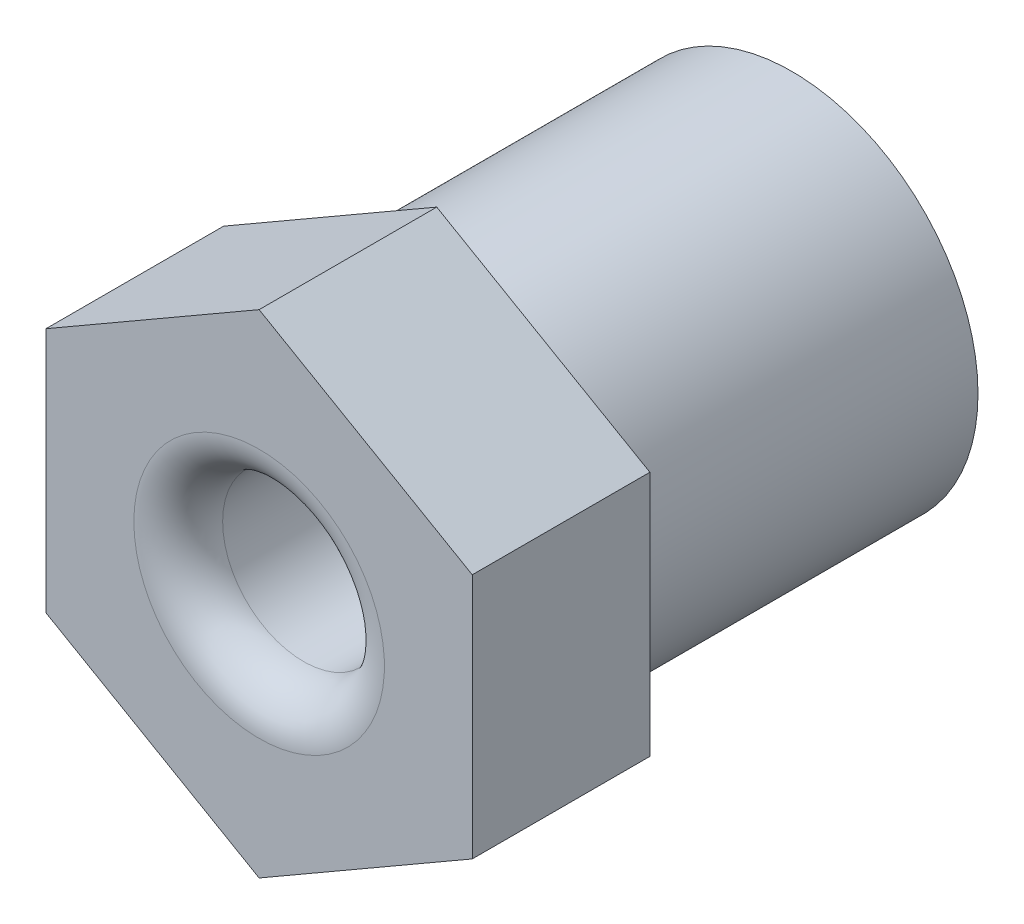
ISO-10303-21;
HEADER;
FILE_DESCRIPTION(('STEP AP214'),'2;1');
FILE_NAME('part.step','',(''),(''),'','','');
FILE_SCHEMA(('AUTOMOTIVE_DESIGN { 1 0 10303 214 1 1 1 1 }'));
ENDSEC;
DATA;
#1=APPLICATION_CONTEXT('core data for automotive mechanical design processes');
#2=APPLICATION_PROTOCOL_DEFINITION('international standard','automotive_design',2000,#1);
#3=PRODUCT_CONTEXT('',#1,'mechanical');
#4=PRODUCT('Part','Part','',(#3));
#5=PRODUCT_RELATED_PRODUCT_CATEGORY('part','',(#4));
#6=PRODUCT_DEFINITION_FORMATION('','',#4);
#7=PRODUCT_DEFINITION_CONTEXT('part definition',#1,'design');
#8=PRODUCT_DEFINITION('design','',#6,#7);
#9=PRODUCT_DEFINITION_SHAPE('','',#8);
#10=(LENGTH_UNIT() NAMED_UNIT(*) SI_UNIT(.MILLI.,.METRE.));
#11=(NAMED_UNIT(*) PLANE_ANGLE_UNIT() SI_UNIT($,.RADIAN.));
#12=(NAMED_UNIT(*) SI_UNIT($,.STERADIAN.) SOLID_ANGLE_UNIT());
#13=UNCERTAINTY_MEASURE_WITH_UNIT(LENGTH_MEASURE(1.E-05),#10,'distance_accuracy_value','');
#14=(GEOMETRIC_REPRESENTATION_CONTEXT(3) GLOBAL_UNCERTAINTY_ASSIGNED_CONTEXT((#13)) GLOBAL_UNIT_ASSIGNED_CONTEXT((#10,
#11,#12)) REPRESENTATION_CONTEXT('',''));
#15=CARTESIAN_POINT('',(0.,0.,0.));
#16=DIRECTION('',(0.,0.,1.));
#17=DIRECTION('',(1.,0.,0.));
#18=AXIS2_PLACEMENT_3D('',#15,#16,#17);
#19=CARTESIAN_POINT('',(-3.65791116486798,3.45094953686021,0.));
#20=DIRECTION('',(0.,0.,1.));
#21=DIRECTION('',(1.,0.,0.));
#22=AXIS2_PLACEMENT_3D('',#19,#20,#21);
#23=PLANE('',#22);
#24=CARTESIAN_POINT('',(-3.65791116486798,3.45094953686021,0.));
#25=DIRECTION('',(0.,0.,1.));
#26=DIRECTION('',(-1.,0.,0.));
#27=AXIS2_PLACEMENT_3D('',#24,#25,#26);
#28=CIRCLE('',#27,0.91087);
#29=CARTESIAN_POINT('',(-4.56878116486798,3.45094953686021,0.));
#30=VERTEX_POINT('',#29);
#31=EDGE_CURVE('E118',#30,#30,#28,.T.);
#32=ORIENTED_EDGE('',*,*,#31,.T.);
#33=EDGE_LOOP('',(#32));
#34=FACE_BOUND('',#33,.T.);
#35=CARTESIAN_POINT('',(-3.65791116486798,3.45094953686021,0.));
#36=DIRECTION('',(0.,0.,-1.));
#37=DIRECTION('',(1.,0.,0.));
#38=AXIS2_PLACEMENT_3D('',#35,#36,#37);
#39=CIRCLE('',#38,1.6);
#40=CARTESIAN_POINT('',(-2.05791116486798,3.45094953686021,0.));
#41=VERTEX_POINT('',#40);
#42=EDGE_CURVE('E127',#41,#41,#39,.T.);
#43=ORIENTED_EDGE('',*,*,#42,.T.);
#44=EDGE_LOOP('',(#43));
#45=FACE_BOUND('',#44,.T.);
#46=ADVANCED_FACE('F17',(#34,#45),#23,.F.);
#47=CARTESIAN_POINT('',(-1.25791116486653,4.83659053686006,0.));
#48=DIRECTION('',(1.,0.,0.));
#49=DIRECTION('',(0.,1.,0.));
#50=AXIS2_PLACEMENT_3D('',#47,#48,#49);
#51=PLANE('',#50);
#52=DIRECTION('',(0.,-1.,0.));
#53=VECTOR('',#52,1.);
#54=CARTESIAN_POINT('',(-1.25791116486653,4.83659053686006,2.));
#55=LINE('',#54,#53);
#56=CARTESIAN_POINT('',(-1.25791116486653,4.83659053686006,2.));
#57=VERTEX_POINT('',#56);
#58=CARTESIAN_POINT('',(-1.25791116486653,2.06530853686036,2.));
#59=VERTEX_POINT('',#58);
#60=EDGE_CURVE('E161',#57,#59,#55,.T.);
#61=ORIENTED_EDGE('',*,*,#60,.T.);
#62=DIRECTION('',(0.,0.,1.));
#63=VECTOR('',#62,1.);
#64=CARTESIAN_POINT('',(-1.25791116486653,2.06530853686036,0.));
#65=LINE('',#64,#63);
#66=CARTESIAN_POINT('',(-1.25791116486653,2.06530853686036,0.));
#67=VERTEX_POINT('',#66);
#68=EDGE_CURVE('E154',#67,#59,#65,.T.);
#69=ORIENTED_EDGE('',*,*,#68,.F.);
#70=DIRECTION('',(0.,-1.,0.));
#71=VECTOR('',#70,1.);
#72=CARTESIAN_POINT('',(-1.25791116486653,4.83659053686006,0.));
#73=LINE('',#72,#71);
#74=CARTESIAN_POINT('',(-1.25791116486653,4.83659053686006,0.));
#75=VERTEX_POINT('',#74);
#76=EDGE_CURVE('E146',#75,#67,#73,.T.);
#77=ORIENTED_EDGE('',*,*,#76,.F.);
#78=DIRECTION('',(0.,0.,1.));
#79=VECTOR('',#78,1.);
#80=CARTESIAN_POINT('',(-1.25791116486653,4.83659053686006,0.));
#81=LINE('',#80,#79);
#82=EDGE_CURVE('E11',#75,#57,#81,.T.);
#83=ORIENTED_EDGE('',*,*,#82,.T.);
#84=EDGE_LOOP('',(#61,#69,#77,#83));
#85=FACE_BOUND('',#84,.T.);
#86=ADVANCED_FACE('F189',(#85),#51,.T.);
#87=CARTESIAN_POINT('',(-3.65791116486798,6.22223053686048,0.));
#88=DIRECTION('',(0.499999825156066,0.866025504730608,0.));
#89=DIRECTION('',(0.,0.,-1.));
#90=AXIS2_PLACEMENT_3D('',#87,#88,#89);
#91=PLANE('',#90);
#92=DIRECTION('',(0.866025504730608,-0.499999825156065,0.));
#93=VECTOR('',#92,1.);
#94=CARTESIAN_POINT('',(-3.65791116486798,6.22223053686048,2.));
#95=LINE('',#94,#93);
#96=CARTESIAN_POINT('',(-3.65791116486798,6.22223053686048,2.));
#97=VERTEX_POINT('',#96);
#98=EDGE_CURVE('E162',#97,#57,#95,.T.);
#99=ORIENTED_EDGE('',*,*,#98,.T.);
#100=ORIENTED_EDGE('',*,*,#82,.F.);
#101=DIRECTION('',(0.866025504730608,-0.499999825156065,0.));
#102=VECTOR('',#101,1.);
#103=CARTESIAN_POINT('',(-3.65791116486798,6.22223053686048,0.));
#104=LINE('',#103,#102);
#105=CARTESIAN_POINT('',(-3.65791116486798,6.22223053686048,0.));
#106=VERTEX_POINT('',#105);
#107=EDGE_CURVE('E101',#106,#75,#104,.T.);
#108=ORIENTED_EDGE('',*,*,#107,.F.);
#109=DIRECTION('',(0.,0.,1.));
#110=VECTOR('',#109,1.);
#111=CARTESIAN_POINT('',(-3.65791116486798,6.22223053686048,0.));
#112=LINE('',#111,#110);
#113=EDGE_CURVE('E25',#106,#97,#112,.T.);
#114=ORIENTED_EDGE('',*,*,#113,.T.);
#115=EDGE_LOOP('',(#99,#100,#108,#114));
#116=FACE_BOUND('',#115,.T.);
#117=ADVANCED_FACE('F181',(#116),#91,.T.);
#118=CARTESIAN_POINT('',(-6.05791116486944,4.83659053686006,0.));
#119=DIRECTION('',(-0.499999825156066,0.866025504730608,0.));
#120=DIRECTION('',(0.,0.,1.));
#121=AXIS2_PLACEMENT_3D('',#118,#119,#120);
#122=PLANE('',#121);
#123=DIRECTION('',(0.866025504730608,0.499999825156065,0.));
#124=VECTOR('',#123,1.);
#125=CARTESIAN_POINT('',(-6.05791116486944,4.83659053686006,2.));
#126=LINE('',#125,#124);
#127=CARTESIAN_POINT('',(-6.05791116486944,4.83659053686006,2.));
#128=VERTEX_POINT('',#127);
#129=EDGE_CURVE('E166',#128,#97,#126,.T.);
#130=ORIENTED_EDGE('',*,*,#129,.T.);
#131=ORIENTED_EDGE('',*,*,#113,.F.);
#132=DIRECTION('',(0.866025504730608,0.499999825156065,0.));
#133=VECTOR('',#132,1.);
#134=CARTESIAN_POINT('',(-6.05791116486944,4.83659053686006,0.));
#135=LINE('',#134,#133);
#136=CARTESIAN_POINT('',(-6.05791116486944,4.83659053686006,0.));
#137=VERTEX_POINT('',#136);
#138=EDGE_CURVE('E95',#137,#106,#135,.T.);
#139=ORIENTED_EDGE('',*,*,#138,.F.);
#140=DIRECTION('',(0.,0.,1.));
#141=VECTOR('',#140,1.);
#142=CARTESIAN_POINT('',(-6.05791116486944,4.83659053686006,0.));
#143=LINE('',#142,#141);
#144=EDGE_CURVE('E47',#137,#128,#143,.T.);
#145=ORIENTED_EDGE('',*,*,#144,.T.);
#146=EDGE_LOOP('',(#130,#131,#139,#145));
#147=FACE_BOUND('',#146,.T.);
#148=ADVANCED_FACE('F96',(#147),#122,.T.);
#149=CARTESIAN_POINT('',(-6.05791116486944,2.06530853686036,0.));
#150=DIRECTION('',(-1.,0.,0.));
#151=DIRECTION('',(0.,0.,1.));
#152=AXIS2_PLACEMENT_3D('',#149,#150,#151);
#153=PLANE('',#152);
#154=DIRECTION('',(0.,1.,0.));
#155=VECTOR('',#154,1.);
#156=CARTESIAN_POINT('',(-6.05791116486944,2.06530853686036,2.));
#157=LINE('',#156,#155);
#158=CARTESIAN_POINT('',(-6.05791116486944,2.06530853686036,2.));
#159=VERTEX_POINT('',#158);
#160=EDGE_CURVE('E90',#159,#128,#157,.T.);
#161=ORIENTED_EDGE('',*,*,#160,.T.);
#162=ORIENTED_EDGE('',*,*,#144,.F.);
#163=DIRECTION('',(0.,1.,0.));
#164=VECTOR('',#163,1.);
#165=CARTESIAN_POINT('',(-6.05791116486944,2.06530853686036,0.));
#166=LINE('',#165,#164);
#167=CARTESIAN_POINT('',(-6.05791116486944,2.06530853686036,0.));
#168=VERTEX_POINT('',#167);
#169=EDGE_CURVE('E87',#168,#137,#166,.T.);
#170=ORIENTED_EDGE('',*,*,#169,.F.);
#171=DIRECTION('',(0.,0.,1.));
#172=VECTOR('',#171,1.);
#173=CARTESIAN_POINT('',(-6.05791116486944,2.06530853686036,0.));
#174=LINE('',#173,#172);
#175=EDGE_CURVE('E37',#168,#159,#174,.T.);
#176=ORIENTED_EDGE('',*,*,#175,.T.);
#177=EDGE_LOOP('',(#161,#162,#170,#176));
#178=FACE_BOUND('',#177,.T.);
#179=ADVANCED_FACE('F85',(#178),#153,.T.);
#180=CARTESIAN_POINT('',(-3.65791116486798,0.679668536859936,0.));
#181=DIRECTION('',(-0.499999825156065,-0.866025504730608,0.));
#182=DIRECTION('',(-0.866025504730608,0.499999825156065,0.));
#183=AXIS2_PLACEMENT_3D('',#180,#181,#182);
#184=PLANE('',#183);
#185=DIRECTION('',(-0.866025504730608,0.499999825156065,0.));
#186=VECTOR('',#185,1.);
#187=CARTESIAN_POINT('',(-3.65791116486798,0.679668536859936,2.));
#188=LINE('',#187,#186);
#189=CARTESIAN_POINT('',(-3.65791116486798,0.679668536859936,2.));
#190=VERTEX_POINT('',#189);
#191=EDGE_CURVE('E119',#190,#159,#188,.T.);
#192=ORIENTED_EDGE('',*,*,#191,.T.);
#193=ORIENTED_EDGE('',*,*,#175,.F.);
#194=DIRECTION('',(-0.866025504730608,0.499999825156065,0.));
#195=VECTOR('',#194,1.);
#196=CARTESIAN_POINT('',(-3.65791116486798,0.679668536859936,0.));
#197=LINE('',#196,#195);
#198=CARTESIAN_POINT('',(-3.65791116486798,0.679668536859936,0.));
#199=VERTEX_POINT('',#198);
#200=EDGE_CURVE('E107',#199,#168,#197,.T.);
#201=ORIENTED_EDGE('',*,*,#200,.F.);
#202=DIRECTION('',(0.,0.,1.));
#203=VECTOR('',#202,1.);
#204=CARTESIAN_POINT('',(-3.65791116486798,0.679668536859936,0.));
#205=LINE('',#204,#203);
#206=EDGE_CURVE('E122',#199,#190,#205,.T.);
#207=ORIENTED_EDGE('',*,*,#206,.T.);
#208=EDGE_LOOP('',(#192,#193,#201,#207));
#209=FACE_BOUND('',#208,.T.);
#210=ADVANCED_FACE('F195',(#209),#184,.T.);
#211=CARTESIAN_POINT('',(-1.25791116486653,2.06530853686036,0.));
#212=DIRECTION('',(0.499999825156065,-0.866025504730608,0.));
#213=DIRECTION('',(0.,0.,-1.));
#214=AXIS2_PLACEMENT_3D('',#211,#212,#213);
#215=PLANE('',#214);
#216=DIRECTION('',(-0.866025504730608,-0.499999825156065,0.));
#217=VECTOR('',#216,1.);
#218=CARTESIAN_POINT('',(-1.25791116486653,2.06530853686036,2.));
#219=LINE('',#218,#217);
#220=EDGE_CURVE('E157',#59,#190,#219,.T.);
#221=ORIENTED_EDGE('',*,*,#220,.T.);
#222=ORIENTED_EDGE('',*,*,#206,.F.);
#223=DIRECTION('',(-0.866025504730608,-0.499999825156065,0.));
#224=VECTOR('',#223,1.);
#225=CARTESIAN_POINT('',(-1.25791116486653,2.06530853686036,0.));
#226=LINE('',#225,#224);
#227=EDGE_CURVE('E114',#67,#199,#226,.T.);
#228=ORIENTED_EDGE('',*,*,#227,.F.);
#229=ORIENTED_EDGE('',*,*,#68,.T.);
#230=EDGE_LOOP('',(#221,#222,#228,#229));
#231=FACE_BOUND('',#230,.T.);
#232=ADVANCED_FACE('F193',(#231),#215,.T.);
#233=CARTESIAN_POINT('',(-3.65791116486798,3.45094953686021,2.));
#234=DIRECTION('',(0.,0.,1.));
#235=DIRECTION('',(1.,0.,0.));
#236=AXIS2_PLACEMENT_3D('',#233,#234,#235);
#237=PLANE('',#236);
#238=CARTESIAN_POINT('',(-3.65791116486798,3.45094953686021,2.));
#239=DIRECTION('',(0.,0.,1.));
#240=DIRECTION('',(-1.,0.,0.));
#241=AXIS2_PLACEMENT_3D('',#238,#239,#240);
#242=CIRCLE('',#241,1.41087);
#243=CARTESIAN_POINT('',(-5.06878116486799,3.45094953686021,2.));
#244=VERTEX_POINT('',#243);
#245=EDGE_CURVE('E132',#244,#244,#242,.T.);
#246=ORIENTED_EDGE('',*,*,#245,.F.);
#247=EDGE_LOOP('',(#246));
#248=FACE_BOUND('',#247,.T.);
#249=ORIENTED_EDGE('',*,*,#220,.F.);
#250=ORIENTED_EDGE('',*,*,#60,.F.);
#251=ORIENTED_EDGE('',*,*,#98,.F.);
#252=ORIENTED_EDGE('',*,*,#129,.F.);
#253=ORIENTED_EDGE('',*,*,#160,.F.);
#254=ORIENTED_EDGE('',*,*,#191,.F.);
#255=EDGE_LOOP('',(#249,#250,#251,#252,#253,#254));
#256=FACE_BOUND('',#255,.T.);
#257=ADVANCED_FACE('F186',(#248,#256),#237,.T.);
#258=CARTESIAN_POINT('',(-3.65791116486798,3.45094953686021,2.));
#259=DIRECTION('',(0.,0.,-1.));
#260=DIRECTION('',(-1.,0.,0.));
#261=AXIS2_PLACEMENT_3D('',#258,#259,#260);
#262=CYLINDRICAL_SURFACE('',#261,0.91087);
#263=CARTESIAN_POINT('',(-3.65791116486798,3.45094953686021,1.5));
#264=DIRECTION('',(0.,0.,-1.));
#265=DIRECTION('',(-1.,0.,0.));
#266=AXIS2_PLACEMENT_3D('',#263,#264,#265);
#267=CIRCLE('',#266,0.91087);
#268=CARTESIAN_POINT('',(-4.56878116486798,3.45094953686021,1.5));
#269=VERTEX_POINT('',#268);
#270=EDGE_CURVE('E136',#269,#269,#267,.T.);
#271=ORIENTED_EDGE('',*,*,#270,.F.);
#272=EDGE_LOOP('',(#271));
#273=FACE_BOUND('',#272,.T.);
#274=ORIENTED_EDGE('',*,*,#31,.F.);
#275=EDGE_LOOP('',(#274));
#276=FACE_BOUND('',#275,.T.);
#277=ADVANCED_FACE('F241',(#273,#276),#262,.F.);
#278=CARTESIAN_POINT('',(-3.65791116486798,3.45094953686021,1.5));
#279=DIRECTION('',(0.,0.,-1.));
#280=DIRECTION('',(-1.,0.,0.));
#281=AXIS2_PLACEMENT_3D('',#278,#279,#280);
#282=TOROIDAL_SURFACE('',#281,1.41087,0.5);
#283=ORIENTED_EDGE('',*,*,#245,.T.);
#284=EDGE_LOOP('',(#283));
#285=FACE_BOUND('',#284,.T.);
#286=ORIENTED_EDGE('',*,*,#270,.T.);
#287=EDGE_LOOP('',(#286));
#288=FACE_BOUND('',#287,.T.);
#289=ADVANCED_FACE('F239',(#285,#288),#282,.T.);
#290=CARTESIAN_POINT('',(-3.65791116486798,3.45094953686021,0.));
#291=DIRECTION('',(0.,0.,1.));
#292=DIRECTION('',(1.,0.,0.));
#293=AXIS2_PLACEMENT_3D('',#290,#291,#292);
#294=PLANE('',#293);
#295=CARTESIAN_POINT('',(-3.65791116486798,3.45094953686021,0.));
#296=DIRECTION('',(0.,0.,1.));
#297=DIRECTION('',(1.,0.,0.));
#298=AXIS2_PLACEMENT_3D('',#295,#296,#297);
#299=CIRCLE('',#298,2.095);
#300=CARTESIAN_POINT('',(-1.56291116486798,3.45094953686021,0.));
#301=VERTEX_POINT('',#300);
#302=EDGE_CURVE('E140',#301,#301,#299,.T.);
#303=ORIENTED_EDGE('',*,*,#302,.T.);
#304=EDGE_LOOP('',(#303));
#305=FACE_BOUND('',#304,.T.);
#306=ORIENTED_EDGE('',*,*,#76,.T.);
#307=ORIENTED_EDGE('',*,*,#227,.T.);
#308=ORIENTED_EDGE('',*,*,#200,.T.);
#309=ORIENTED_EDGE('',*,*,#169,.T.);
#310=ORIENTED_EDGE('',*,*,#138,.T.);
#311=ORIENTED_EDGE('',*,*,#107,.T.);
#312=EDGE_LOOP('',(#306,#307,#308,#309,#310,#311));
#313=FACE_BOUND('',#312,.T.);
#314=ADVANCED_FACE('F104',(#305,#313),#294,.F.);
#315=CARTESIAN_POINT('',(-3.65791116486798,3.45094953686021,-4.));
#316=DIRECTION('',(0.,0.,1.));
#317=DIRECTION('',(1.,0.,0.));
#318=AXIS2_PLACEMENT_3D('',#315,#316,#317);
#319=PLANE('',#318);
#320=CARTESIAN_POINT('',(-3.65791116486798,3.45094953686021,-4.));
#321=DIRECTION('',(0.,0.,1.));
#322=DIRECTION('',(1.,0.,0.));
#323=AXIS2_PLACEMENT_3D('',#320,#321,#322);
#324=CIRCLE('',#323,1.6);
#325=CARTESIAN_POINT('',(-2.05791116486798,3.45094953686021,-4.));
#326=VERTEX_POINT('',#325);
#327=EDGE_CURVE('E123',#326,#326,#324,.T.);
#328=ORIENTED_EDGE('',*,*,#327,.T.);
#329=EDGE_LOOP('',(#328));
#330=FACE_BOUND('',#329,.T.);
#331=CARTESIAN_POINT('',(-3.65791116486798,3.45094953686021,-4.));
#332=DIRECTION('',(0.,0.,1.));
#333=DIRECTION('',(1.,0.,0.));
#334=AXIS2_PLACEMENT_3D('',#331,#332,#333);
#335=CIRCLE('',#334,2.095);
#336=CARTESIAN_POINT('',(-1.56291116486798,3.45094953686021,-4.));
#337=VERTEX_POINT('',#336);
#338=EDGE_CURVE('E131',#337,#337,#335,.T.);
#339=ORIENTED_EDGE('',*,*,#338,.F.);
#340=EDGE_LOOP('',(#339));
#341=FACE_BOUND('',#340,.T.);
#342=ADVANCED_FACE('F224',(#330,#341),#319,.F.);
#343=CARTESIAN_POINT('',(-3.65791116486798,3.45094953686021,0.));
#344=DIRECTION('',(0.,0.,-1.));
#345=DIRECTION('',(1.,0.,0.));
#346=AXIS2_PLACEMENT_3D('',#343,#344,#345);
#347=CYLINDRICAL_SURFACE('',#346,2.095);
#348=ORIENTED_EDGE('',*,*,#302,.F.);
#349=EDGE_LOOP('',(#348));
#350=FACE_BOUND('',#349,.T.);
#351=ORIENTED_EDGE('',*,*,#338,.T.);
#352=EDGE_LOOP('',(#351));
#353=FACE_BOUND('',#352,.T.);
#354=ADVANCED_FACE('F220',(#350,#353),#347,.T.);
#355=CARTESIAN_POINT('',(-3.65791116486798,3.45094953686021,0.));
#356=DIRECTION('',(0.,0.,-1.));
#357=DIRECTION('',(1.,0.,0.));
#358=AXIS2_PLACEMENT_3D('',#355,#356,#357);
#359=CYLINDRICAL_SURFACE('',#358,1.6);
#360=ORIENTED_EDGE('',*,*,#42,.F.);
#361=EDGE_LOOP('',(#360));
#362=FACE_BOUND('',#361,.T.);
#363=ORIENTED_EDGE('',*,*,#327,.F.);
#364=EDGE_LOOP('',(#363));
#365=FACE_BOUND('',#364,.T.);
#366=ADVANCED_FACE('F217',(#362,#365),#359,.F.);
#367=CLOSED_SHELL('',(#46,#86,#117,#148,#179,#210,#232,#257,#277,#289,#314,#342,#354,#366));
#368=MANIFOLD_SOLID_BREP('B1',#367);
#369=ADVANCED_BREP_SHAPE_REPRESENTATION('',(#18,#368),#14);
#370=SHAPE_DEFINITION_REPRESENTATION(#9,#369);
ENDSEC;
END-ISO-10303-21;
